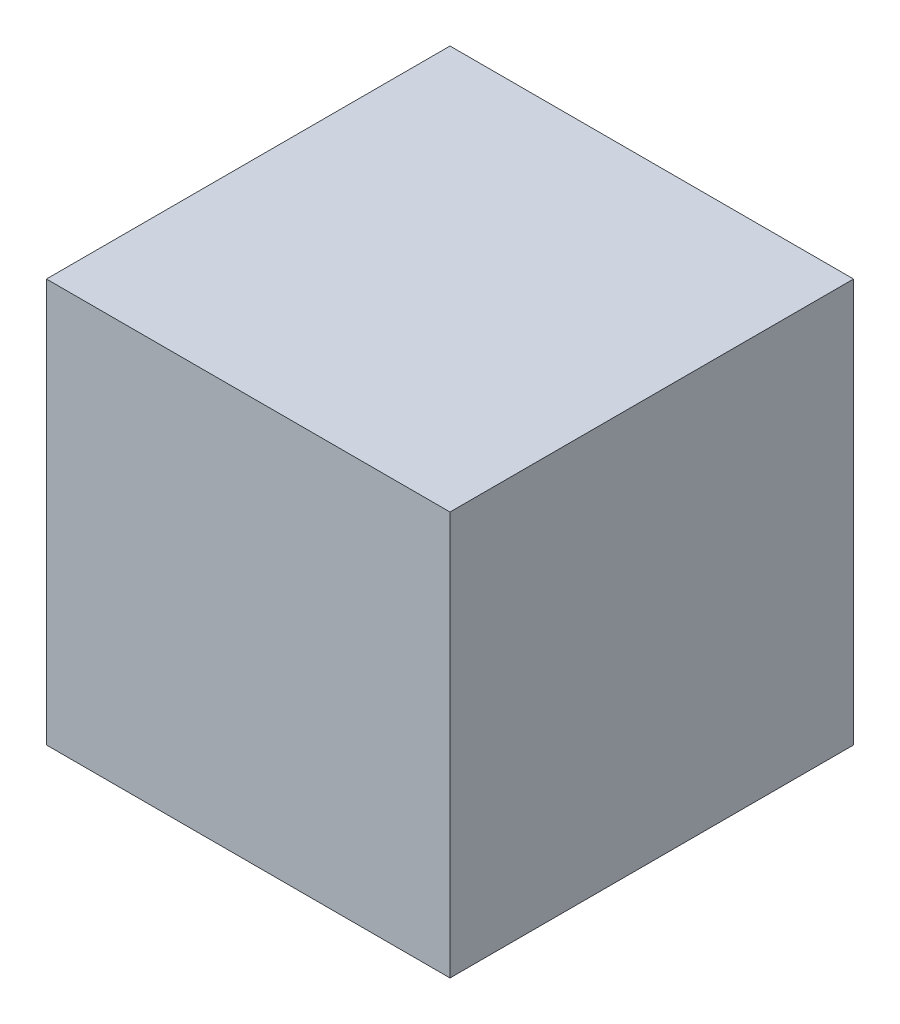
ISO-10303-21;
HEADER;
FILE_DESCRIPTION(('STEP AP214'),'2;1');
FILE_NAME('part.step','',(''),(''),'','','');
FILE_SCHEMA(('AUTOMOTIVE_DESIGN { 1 0 10303 214 1 1 1 1 }'));
ENDSEC;
DATA;
#1=APPLICATION_CONTEXT('core data for automotive mechanical design processes');
#2=APPLICATION_PROTOCOL_DEFINITION('international standard','automotive_design',2000,#1);
#3=PRODUCT_CONTEXT('',#1,'mechanical');
#4=PRODUCT('Part','Part','',(#3));
#5=PRODUCT_RELATED_PRODUCT_CATEGORY('part','',(#4));
#6=PRODUCT_DEFINITION_FORMATION('','',#4);
#7=PRODUCT_DEFINITION_CONTEXT('part definition',#1,'design');
#8=PRODUCT_DEFINITION('design','',#6,#7);
#9=PRODUCT_DEFINITION_SHAPE('','',#8);
#10=(LENGTH_UNIT() NAMED_UNIT(*) SI_UNIT(.MILLI.,.METRE.));
#11=(NAMED_UNIT(*) PLANE_ANGLE_UNIT() SI_UNIT($,.RADIAN.));
#12=(NAMED_UNIT(*) SI_UNIT($,.STERADIAN.) SOLID_ANGLE_UNIT());
#13=UNCERTAINTY_MEASURE_WITH_UNIT(LENGTH_MEASURE(1.E-05),#10,'distance_accuracy_value','');
#14=(GEOMETRIC_REPRESENTATION_CONTEXT(3) GLOBAL_UNCERTAINTY_ASSIGNED_CONTEXT((#13)) GLOBAL_UNIT_ASSIGNED_CONTEXT((#10,
#11,#12)) REPRESENTATION_CONTEXT('',''));
#15=CARTESIAN_POINT('',(0.,0.,0.));
#16=DIRECTION('',(0.,0.,1.));
#17=DIRECTION('',(1.,0.,0.));
#18=AXIS2_PLACEMENT_3D('',#15,#16,#17);
#19=CARTESIAN_POINT('',(0.,0.,100.));
#20=DIRECTION('',(1.,0.,0.));
#21=DIRECTION('',(0.,0.,-1.));
#22=AXIS2_PLACEMENT_3D('',#19,#20,#21);
#23=PLANE('',#22);
#24=DIRECTION('',(0.,-1.,0.));
#25=VECTOR('',#24,1.);
#26=CARTESIAN_POINT('',(0.,0.,0.));
#27=LINE('',#26,#25);
#28=CARTESIAN_POINT('',(0.,100.,0.));
#29=VERTEX_POINT('',#28);
#30=CARTESIAN_POINT('',(0.,0.,0.));
#31=VERTEX_POINT('',#30);
#32=EDGE_CURVE('E98',#29,#31,#27,.T.);
#33=ORIENTED_EDGE('',*,*,#32,.T.);
#34=DIRECTION('',(0.,0.,-1.));
#35=VECTOR('',#34,1.);
#36=CARTESIAN_POINT('',(0.,0.,100.));
#37=LINE('',#36,#35);
#38=CARTESIAN_POINT('',(0.,0.,100.));
#39=VERTEX_POINT('',#38);
#40=EDGE_CURVE('E11',#39,#31,#37,.T.);
#41=ORIENTED_EDGE('',*,*,#40,.F.);
#42=DIRECTION('',(0.,-1.,0.));
#43=VECTOR('',#42,1.);
#44=CARTESIAN_POINT('',(0.,0.,100.));
#45=LINE('',#44,#43);
#46=CARTESIAN_POINT('',(0.,100.,100.));
#47=VERTEX_POINT('',#46);
#48=EDGE_CURVE('E86',#47,#39,#45,.T.);
#49=ORIENTED_EDGE('',*,*,#48,.F.);
#50=DIRECTION('',(0.,0.,-1.));
#51=VECTOR('',#50,1.);
#52=CARTESIAN_POINT('',(0.,100.,100.));
#53=LINE('',#52,#51);
#54=EDGE_CURVE('E94',#47,#29,#53,.T.);
#55=ORIENTED_EDGE('',*,*,#54,.T.);
#56=EDGE_LOOP('',(#33,#41,#49,#55));
#57=FACE_BOUND('',#56,.T.);
#58=ADVANCED_FACE('F35',(#57),#23,.F.);
#59=CARTESIAN_POINT('',(0.,0.,100.));
#60=DIRECTION('',(0.,1.,0.));
#61=DIRECTION('',(0.,0.,1.));
#62=AXIS2_PLACEMENT_3D('',#59,#60,#61);
#63=PLANE('',#62);
#64=DIRECTION('',(1.,0.,0.));
#65=VECTOR('',#64,1.);
#66=CARTESIAN_POINT('',(0.,0.,0.));
#67=LINE('',#66,#65);
#68=CARTESIAN_POINT('',(100.,0.,0.));
#69=VERTEX_POINT('',#68);
#70=EDGE_CURVE('E90',#31,#69,#67,.T.);
#71=ORIENTED_EDGE('',*,*,#70,.T.);
#72=DIRECTION('',(0.,0.,-1.));
#73=VECTOR('',#72,1.);
#74=CARTESIAN_POINT('',(100.,0.,100.));
#75=LINE('',#74,#73);
#76=CARTESIAN_POINT('',(100.,0.,100.));
#77=VERTEX_POINT('',#76);
#78=EDGE_CURVE('E43',#77,#69,#75,.T.);
#79=ORIENTED_EDGE('',*,*,#78,.F.);
#80=DIRECTION('',(1.,0.,0.));
#81=VECTOR('',#80,1.);
#82=CARTESIAN_POINT('',(0.,0.,100.));
#83=LINE('',#82,#81);
#84=EDGE_CURVE('E81',#39,#77,#83,.T.);
#85=ORIENTED_EDGE('',*,*,#84,.F.);
#86=ORIENTED_EDGE('',*,*,#40,.T.);
#87=EDGE_LOOP('',(#71,#79,#85,#86));
#88=FACE_BOUND('',#87,.T.);
#89=ADVANCED_FACE('F89',(#88),#63,.F.);
#90=CARTESIAN_POINT('',(100.,0.,100.));
#91=DIRECTION('',(-1.,0.,0.));
#92=DIRECTION('',(0.,0.,1.));
#93=AXIS2_PLACEMENT_3D('',#90,#91,#92);
#94=PLANE('',#93);
#95=DIRECTION('',(0.,1.,0.));
#96=VECTOR('',#95,1.);
#97=CARTESIAN_POINT('',(100.,0.,0.));
#98=LINE('',#97,#96);
#99=CARTESIAN_POINT('',(100.,100.,0.));
#100=VERTEX_POINT('',#99);
#101=EDGE_CURVE('E68',#69,#100,#98,.T.);
#102=ORIENTED_EDGE('',*,*,#101,.T.);
#103=DIRECTION('',(0.,0.,-1.));
#104=VECTOR('',#103,1.);
#105=CARTESIAN_POINT('',(100.,100.,100.));
#106=LINE('',#105,#104);
#107=CARTESIAN_POINT('',(100.,100.,100.));
#108=VERTEX_POINT('',#107);
#109=EDGE_CURVE('E91',#108,#100,#106,.T.);
#110=ORIENTED_EDGE('',*,*,#109,.F.);
#111=DIRECTION('',(0.,1.,0.));
#112=VECTOR('',#111,1.);
#113=CARTESIAN_POINT('',(100.,0.,100.));
#114=LINE('',#113,#112);
#115=EDGE_CURVE('E84',#77,#108,#114,.T.);
#116=ORIENTED_EDGE('',*,*,#115,.F.);
#117=ORIENTED_EDGE('',*,*,#78,.T.);
#118=EDGE_LOOP('',(#102,#110,#116,#117));
#119=FACE_BOUND('',#118,.T.);
#120=ADVANCED_FACE('F92',(#119),#94,.F.);
#121=CARTESIAN_POINT('',(0.,100.,100.));
#122=DIRECTION('',(0.,-1.,0.));
#123=DIRECTION('',(0.,0.,-1.));
#124=AXIS2_PLACEMENT_3D('',#121,#122,#123);
#125=PLANE('',#124);
#126=DIRECTION('',(-1.,0.,0.));
#127=VECTOR('',#126,1.);
#128=CARTESIAN_POINT('',(0.,100.,0.));
#129=LINE('',#128,#127);
#130=EDGE_CURVE('E74',#100,#29,#129,.T.);
#131=ORIENTED_EDGE('',*,*,#130,.T.);
#132=ORIENTED_EDGE('',*,*,#54,.F.);
#133=DIRECTION('',(-1.,0.,0.));
#134=VECTOR('',#133,1.);
#135=CARTESIAN_POINT('',(0.,100.,100.));
#136=LINE('',#135,#134);
#137=EDGE_CURVE('E51',#108,#47,#136,.T.);
#138=ORIENTED_EDGE('',*,*,#137,.F.);
#139=ORIENTED_EDGE('',*,*,#109,.T.);
#140=EDGE_LOOP('',(#131,#132,#138,#139));
#141=FACE_BOUND('',#140,.T.);
#142=ADVANCED_FACE('F105',(#141),#125,.F.);
#143=CARTESIAN_POINT('',(0.,0.,100.));
#144=DIRECTION('',(0.,0.,-1.));
#145=DIRECTION('',(-1.,0.,0.));
#146=AXIS2_PLACEMENT_3D('',#143,#144,#145);
#147=PLANE('',#146);
#148=ORIENTED_EDGE('',*,*,#48,.T.);
#149=ORIENTED_EDGE('',*,*,#84,.T.);
#150=ORIENTED_EDGE('',*,*,#115,.T.);
#151=ORIENTED_EDGE('',*,*,#137,.T.);
#152=EDGE_LOOP('',(#148,#149,#150,#151));
#153=FACE_BOUND('',#152,.T.);
#154=ADVANCED_FACE('F82',(#153),#147,.F.);
#155=CARTESIAN_POINT('',(0.,0.,0.));
#156=DIRECTION('',(0.,0.,-1.));
#157=DIRECTION('',(-1.,0.,0.));
#158=AXIS2_PLACEMENT_3D('',#155,#156,#157);
#159=PLANE('',#158);
#160=ORIENTED_EDGE('',*,*,#32,.F.);
#161=ORIENTED_EDGE('',*,*,#130,.F.);
#162=ORIENTED_EDGE('',*,*,#101,.F.);
#163=ORIENTED_EDGE('',*,*,#70,.F.);
#164=EDGE_LOOP('',(#160,#161,#162,#163));
#165=FACE_BOUND('',#164,.T.);
#166=ADVANCED_FACE('F108',(#165),#159,.T.);
#167=CLOSED_SHELL('',(#58,#89,#120,#142,#154,#166));
#168=MANIFOLD_SOLID_BREP('B2',#167);
#169=ADVANCED_BREP_SHAPE_REPRESENTATION('',(#18,#168),#14);
#170=SHAPE_DEFINITION_REPRESENTATION(#9,#169);
ENDSEC;
END-ISO-10303-21;
